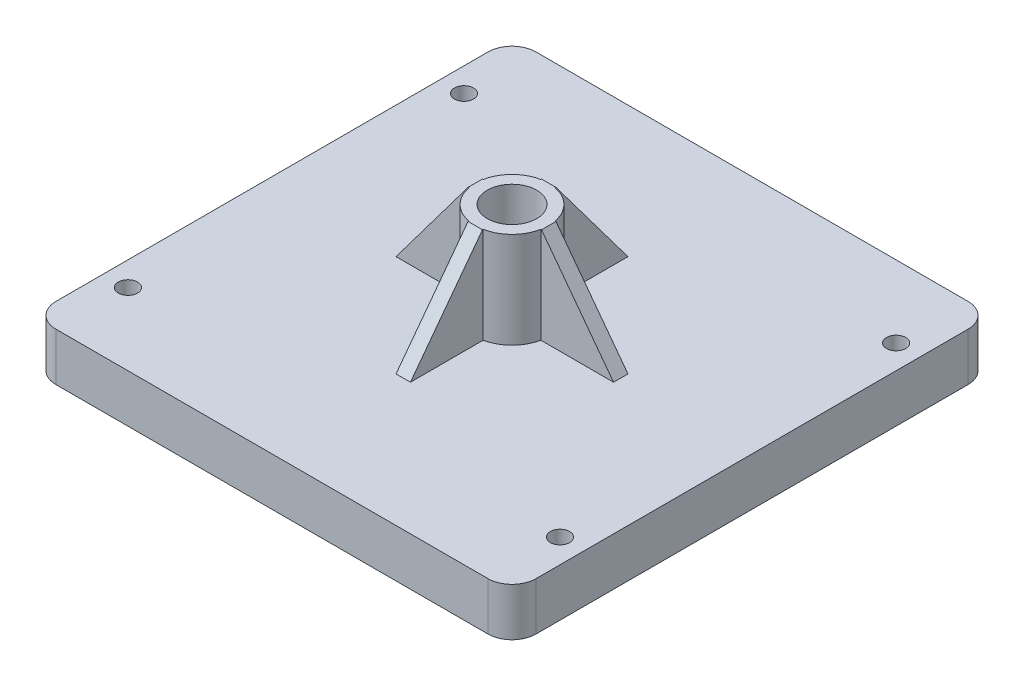
ISO-10303-21;
HEADER;
FILE_DESCRIPTION(('STEP AP214'),'2;1');
FILE_NAME('part.step','',(''),(''),'','','');
FILE_SCHEMA(('AUTOMOTIVE_DESIGN { 1 0 10303 214 1 1 1 1 }'));
ENDSEC;
DATA;
#1=APPLICATION_CONTEXT('core data for automotive mechanical design processes');
#2=APPLICATION_PROTOCOL_DEFINITION('international standard','automotive_design',2000,#1);
#3=PRODUCT_CONTEXT('',#1,'mechanical');
#4=PRODUCT('Part','Part','',(#3));
#5=PRODUCT_RELATED_PRODUCT_CATEGORY('part','',(#4));
#6=PRODUCT_DEFINITION_FORMATION('','',#4);
#7=PRODUCT_DEFINITION_CONTEXT('part definition',#1,'design');
#8=PRODUCT_DEFINITION('design','',#6,#7);
#9=PRODUCT_DEFINITION_SHAPE('','',#8);
#10=(LENGTH_UNIT() NAMED_UNIT(*) SI_UNIT(.MILLI.,.METRE.));
#11=(NAMED_UNIT(*) PLANE_ANGLE_UNIT() SI_UNIT($,.RADIAN.));
#12=(NAMED_UNIT(*) SI_UNIT($,.STERADIAN.) SOLID_ANGLE_UNIT());
#13=UNCERTAINTY_MEASURE_WITH_UNIT(LENGTH_MEASURE(1.E-05),#10,'distance_accuracy_value','');
#14=(GEOMETRIC_REPRESENTATION_CONTEXT(3) GLOBAL_UNCERTAINTY_ASSIGNED_CONTEXT((#13)) GLOBAL_UNIT_ASSIGNED_CONTEXT((#10,
#11,#12)) REPRESENTATION_CONTEXT('',''));
#15=CARTESIAN_POINT('',(0.,0.,0.));
#16=DIRECTION('',(0.,0.,1.));
#17=DIRECTION('',(1.,0.,0.));
#18=AXIS2_PLACEMENT_3D('',#15,#16,#17);
#19=CARTESIAN_POINT('',(0.,30.,0.));
#20=DIRECTION('',(0.,-1.,0.));
#21=DIRECTION('',(0.,0.,-1.));
#22=AXIS2_PLACEMENT_3D('',#19,#20,#21);
#23=CYLINDRICAL_SURFACE('',#22,7.65);
#24=DIRECTION('',(0.,-1.,0.));
#25=VECTOR('',#24,1.);
#26=CARTESIAN_POINT('',(-1.50000000000008,30.,7.50149985002998));
#27=LINE('',#26,#25);
#28=CARTESIAN_POINT('',(-1.50000000000008,30.,7.50149985002998));
#29=VERTEX_POINT('',#28);
#30=CARTESIAN_POINT('',(-1.50000000000008,10.,7.50149985002998));
#31=VERTEX_POINT('',#30);
#32=EDGE_CURVE('E304',#29,#31,#27,.T.);
#33=ORIENTED_EDGE('',*,*,#32,.F.);
#34=CARTESIAN_POINT('',(0.,30.,0.));
#35=DIRECTION('',(0.,1.,0.));
#36=DIRECTION('',(1.,0.,0.));
#37=AXIS2_PLACEMENT_3D('',#34,#35,#36);
#38=CIRCLE('',#37,7.65);
#39=CARTESIAN_POINT('',(-7.50149985002999,30.,1.5));
#40=VERTEX_POINT('',#39);
#41=EDGE_CURVE('E400',#40,#29,#38,.T.);
#42=ORIENTED_EDGE('',*,*,#41,.F.);
#43=DIRECTION('',(0.,-1.,0.));
#44=VECTOR('',#43,1.);
#45=CARTESIAN_POINT('',(-7.50149985002999,30.,1.5));
#46=LINE('',#45,#44);
#47=CARTESIAN_POINT('',(-7.50149985002999,10.,1.5));
#48=VERTEX_POINT('',#47);
#49=EDGE_CURVE('E385',#40,#48,#46,.T.);
#50=ORIENTED_EDGE('',*,*,#49,.T.);
#51=CARTESIAN_POINT('',(0.,10.,0.));
#52=DIRECTION('',(0.,1.,0.));
#53=DIRECTION('',(1.,0.,0.));
#54=AXIS2_PLACEMENT_3D('',#51,#52,#53);
#55=CIRCLE('',#54,7.65);
#56=EDGE_CURVE('E406',#48,#31,#55,.T.);
#57=ORIENTED_EDGE('',*,*,#56,.T.);
#58=EDGE_LOOP('',(#33,#42,#50,#57));
#59=FACE_BOUND('',#58,.T.);
#60=ADVANCED_FACE('F39',(#59),#23,.T.);
#61=CARTESIAN_POINT('',(1.49999999999992,30.,7.50149985003001));
#62=VERTEX_POINT('',#61);
#63=CARTESIAN_POINT('',(7.50149985002999,30.,1.5));
#64=VERTEX_POINT('',#63);
#65=EDGE_CURVE('E404',#62,#64,#38,.T.);
#66=ORIENTED_EDGE('',*,*,#65,.F.);
#67=DIRECTION('',(0.,-1.,0.));
#68=VECTOR('',#67,1.);
#69=CARTESIAN_POINT('',(1.49999999999992,30.,7.50149985003001));
#70=LINE('',#69,#68);
#71=CARTESIAN_POINT('',(1.49999999999992,10.,7.50149985003001));
#72=VERTEX_POINT('',#71);
#73=EDGE_CURVE('E308',#62,#72,#70,.T.);
#74=ORIENTED_EDGE('',*,*,#73,.T.);
#75=CARTESIAN_POINT('',(7.50149985002999,10.,1.5));
#76=VERTEX_POINT('',#75);
#77=EDGE_CURVE('E409',#72,#76,#55,.T.);
#78=ORIENTED_EDGE('',*,*,#77,.T.);
#79=DIRECTION('',(0.,-1.,0.));
#80=VECTOR('',#79,1.);
#81=CARTESIAN_POINT('',(7.50149985002999,30.,1.5));
#82=LINE('',#81,#80);
#83=EDGE_CURVE('E326',#64,#76,#82,.T.);
#84=ORIENTED_EDGE('',*,*,#83,.F.);
#85=EDGE_LOOP('',(#66,#74,#78,#84));
#86=FACE_BOUND('',#85,.T.);
#87=ADVANCED_FACE('F535',(#86),#23,.T.);
#88=CARTESIAN_POINT('',(-1.49999999999997,30.,-7.50149985003));
#89=VERTEX_POINT('',#88);
#90=CARTESIAN_POINT('',(-7.50149985002999,30.,-1.5));
#91=VERTEX_POINT('',#90);
#92=EDGE_CURVE('E405',#89,#91,#38,.T.);
#93=ORIENTED_EDGE('',*,*,#92,.F.);
#94=DIRECTION('',(0.,-1.,0.));
#95=VECTOR('',#94,1.);
#96=CARTESIAN_POINT('',(-1.49999999999997,30.,-7.50149985003));
#97=LINE('',#96,#95);
#98=CARTESIAN_POINT('',(-1.49999999999997,10.,-7.50149985003));
#99=VERTEX_POINT('',#98);
#100=EDGE_CURVE('E358',#89,#99,#97,.T.);
#101=ORIENTED_EDGE('',*,*,#100,.T.);
#102=CARTESIAN_POINT('',(-7.50149985002999,10.,-1.5));
#103=VERTEX_POINT('',#102);
#104=EDGE_CURVE('E399',#99,#103,#55,.T.);
#105=ORIENTED_EDGE('',*,*,#104,.T.);
#106=DIRECTION('',(0.,-1.,0.));
#107=VECTOR('',#106,1.);
#108=CARTESIAN_POINT('',(-7.50149985002999,30.,-1.5));
#109=LINE('',#108,#107);
#110=EDGE_CURVE('E381',#91,#103,#109,.T.);
#111=ORIENTED_EDGE('',*,*,#110,.F.);
#112=EDGE_LOOP('',(#93,#101,#105,#111));
#113=FACE_BOUND('',#112,.T.);
#114=ADVANCED_FACE('F542',(#113),#23,.T.);
#115=CARTESIAN_POINT('',(50.,10.,-50.));
#116=DIRECTION('',(-1.,0.,0.));
#117=DIRECTION('',(0.,0.,1.));
#118=AXIS2_PLACEMENT_3D('',#115,#116,#117);
#119=PLANE('',#118);
#120=DIRECTION('',(0.,0.,-1.));
#121=VECTOR('',#120,1.);
#122=CARTESIAN_POINT('',(50.,0.,-50.));
#123=LINE('',#122,#121);
#124=CARTESIAN_POINT('',(50.,0.,45.));
#125=VERTEX_POINT('',#124);
#126=CARTESIAN_POINT('',(50.,0.,-45.));
#127=VERTEX_POINT('',#126);
#128=EDGE_CURVE('E431',#125,#127,#123,.T.);
#129=ORIENTED_EDGE('',*,*,#128,.T.);
#130=DIRECTION('',(0.,-1.,0.));
#131=VECTOR('',#130,1.);
#132=CARTESIAN_POINT('',(50.,10.,-45.));
#133=LINE('',#132,#131);
#134=CARTESIAN_POINT('',(50.,10.,-45.));
#135=VERTEX_POINT('',#134);
#136=EDGE_CURVE('E12',#127,#135,#133,.F.);
#137=ORIENTED_EDGE('',*,*,#136,.T.);
#138=DIRECTION('',(0.,0.,-1.));
#139=VECTOR('',#138,1.);
#140=CARTESIAN_POINT('',(50.,10.,-50.));
#141=LINE('',#140,#139);
#142=CARTESIAN_POINT('',(50.,10.,45.));
#143=VERTEX_POINT('',#142);
#144=EDGE_CURVE('E434',#143,#135,#141,.T.);
#145=ORIENTED_EDGE('',*,*,#144,.F.);
#146=DIRECTION('',(0.,-1.,0.));
#147=VECTOR('',#146,1.);
#148=CARTESIAN_POINT('',(50.,10.,45.));
#149=LINE('',#148,#147);
#150=EDGE_CURVE('E47',#143,#125,#149,.T.);
#151=ORIENTED_EDGE('',*,*,#150,.T.);
#152=EDGE_LOOP('',(#129,#137,#145,#151));
#153=FACE_BOUND('',#152,.T.);
#154=ADVANCED_FACE('F491',(#153),#119,.F.);
#155=CARTESIAN_POINT('',(-50.,10.,-50.));
#156=DIRECTION('',(0.,0.,1.));
#157=DIRECTION('',(1.,0.,0.));
#158=AXIS2_PLACEMENT_3D('',#155,#156,#157);
#159=PLANE('',#158);
#160=DIRECTION('',(-1.,0.,0.));
#161=VECTOR('',#160,1.);
#162=CARTESIAN_POINT('',(-50.,0.,-50.));
#163=LINE('',#162,#161);
#164=CARTESIAN_POINT('',(45.,0.,-50.));
#165=VERTEX_POINT('',#164);
#166=CARTESIAN_POINT('',(-45.,0.,-50.));
#167=VERTEX_POINT('',#166);
#168=EDGE_CURVE('E448',#165,#167,#163,.T.);
#169=ORIENTED_EDGE('',*,*,#168,.T.);
#170=DIRECTION('',(0.,-1.,0.));
#171=VECTOR('',#170,1.);
#172=CARTESIAN_POINT('',(-45.,10.,-50.));
#173=LINE('',#172,#171);
#174=CARTESIAN_POINT('',(-45.,10.,-50.));
#175=VERTEX_POINT('',#174);
#176=EDGE_CURVE('E487',#167,#175,#173,.F.);
#177=ORIENTED_EDGE('',*,*,#176,.T.);
#178=DIRECTION('',(-1.,0.,0.));
#179=VECTOR('',#178,1.);
#180=CARTESIAN_POINT('',(-50.,10.,-50.));
#181=LINE('',#180,#179);
#182=CARTESIAN_POINT('',(45.,10.,-50.));
#183=VERTEX_POINT('',#182);
#184=EDGE_CURVE('E436',#183,#175,#181,.T.);
#185=ORIENTED_EDGE('',*,*,#184,.F.);
#186=DIRECTION('',(0.,-1.,0.));
#187=VECTOR('',#186,1.);
#188=CARTESIAN_POINT('',(45.,10.,-50.));
#189=LINE('',#188,#187);
#190=EDGE_CURVE('E484',#183,#165,#189,.T.);
#191=ORIENTED_EDGE('',*,*,#190,.T.);
#192=EDGE_LOOP('',(#169,#177,#185,#191));
#193=FACE_BOUND('',#192,.T.);
#194=ADVANCED_FACE('F505',(#193),#159,.F.);
#195=CARTESIAN_POINT('',(-50.,10.,-50.));
#196=DIRECTION('',(1.,0.,0.));
#197=DIRECTION('',(0.,0.,-1.));
#198=AXIS2_PLACEMENT_3D('',#195,#196,#197);
#199=PLANE('',#198);
#200=DIRECTION('',(0.,0.,1.));
#201=VECTOR('',#200,1.);
#202=CARTESIAN_POINT('',(-50.,0.,-50.));
#203=LINE('',#202,#201);
#204=CARTESIAN_POINT('',(-50.,0.,-45.));
#205=VERTEX_POINT('',#204);
#206=CARTESIAN_POINT('',(-50.,0.,45.));
#207=VERTEX_POINT('',#206);
#208=EDGE_CURVE('E451',#205,#207,#203,.T.);
#209=ORIENTED_EDGE('',*,*,#208,.T.);
#210=DIRECTION('',(0.,-1.,0.));
#211=VECTOR('',#210,1.);
#212=CARTESIAN_POINT('',(-50.,10.,45.));
#213=LINE('',#212,#211);
#214=CARTESIAN_POINT('',(-50.,10.,45.));
#215=VERTEX_POINT('',#214);
#216=EDGE_CURVE('E474',#207,#215,#213,.F.);
#217=ORIENTED_EDGE('',*,*,#216,.T.);
#218=DIRECTION('',(0.,0.,1.));
#219=VECTOR('',#218,1.);
#220=CARTESIAN_POINT('',(-50.,10.,-50.));
#221=LINE('',#220,#219);
#222=CARTESIAN_POINT('',(-50.,10.,-45.));
#223=VERTEX_POINT('',#222);
#224=EDGE_CURVE('E440',#223,#215,#221,.T.);
#225=ORIENTED_EDGE('',*,*,#224,.F.);
#226=DIRECTION('',(0.,-1.,0.));
#227=VECTOR('',#226,1.);
#228=CARTESIAN_POINT('',(-50.,10.,-45.));
#229=LINE('',#228,#227);
#230=EDGE_CURVE('E471',#223,#205,#229,.T.);
#231=ORIENTED_EDGE('',*,*,#230,.T.);
#232=EDGE_LOOP('',(#209,#217,#225,#231));
#233=FACE_BOUND('',#232,.T.);
#234=ADVANCED_FACE('F517',(#233),#199,.F.);
#235=CARTESIAN_POINT('',(-50.,10.,50.));
#236=DIRECTION('',(0.,0.,-1.));
#237=DIRECTION('',(-1.,0.,0.));
#238=AXIS2_PLACEMENT_3D('',#235,#236,#237);
#239=PLANE('',#238);
#240=DIRECTION('',(1.,0.,0.));
#241=VECTOR('',#240,1.);
#242=CARTESIAN_POINT('',(-50.,10.,50.));
#243=LINE('',#242,#241);
#244=CARTESIAN_POINT('',(-45.,10.,50.));
#245=VERTEX_POINT('',#244);
#246=CARTESIAN_POINT('',(45.,10.,50.));
#247=VERTEX_POINT('',#246);
#248=EDGE_CURVE('E443',#245,#247,#243,.T.);
#249=ORIENTED_EDGE('',*,*,#248,.F.);
#250=DIRECTION('',(0.,-1.,0.));
#251=VECTOR('',#250,1.);
#252=CARTESIAN_POINT('',(-45.,10.,50.));
#253=LINE('',#252,#251);
#254=CARTESIAN_POINT('',(-45.,0.,50.));
#255=VERTEX_POINT('',#254);
#256=EDGE_CURVE('E460',#245,#255,#253,.T.);
#257=ORIENTED_EDGE('',*,*,#256,.T.);
#258=DIRECTION('',(1.,0.,0.));
#259=VECTOR('',#258,1.);
#260=CARTESIAN_POINT('',(-50.,0.,50.));
#261=LINE('',#260,#259);
#262=CARTESIAN_POINT('',(45.,0.,50.));
#263=VERTEX_POINT('',#262);
#264=EDGE_CURVE('E437',#255,#263,#261,.T.);
#265=ORIENTED_EDGE('',*,*,#264,.T.);
#266=DIRECTION('',(0.,-1.,0.));
#267=VECTOR('',#266,1.);
#268=CARTESIAN_POINT('',(45.,10.,50.));
#269=LINE('',#268,#267);
#270=EDGE_CURVE('E458',#263,#247,#269,.F.);
#271=ORIENTED_EDGE('',*,*,#270,.T.);
#272=EDGE_LOOP('',(#249,#257,#265,#271));
#273=FACE_BOUND('',#272,.T.);
#274=ADVANCED_FACE('F525',(#273),#239,.F.);
#275=CARTESIAN_POINT('',(0.,10.,0.));
#276=DIRECTION('',(0.,1.,0.));
#277=DIRECTION('',(0.,0.,1.));
#278=AXIS2_PLACEMENT_3D('',#275,#276,#277);
#279=PLANE('',#278);
#280=ORIENTED_EDGE('',*,*,#224,.T.);
#281=CARTESIAN_POINT('',(-45.,10.,45.));
#282=DIRECTION('',(0.,1.,0.));
#283=DIRECTION('',(0.,0.,1.));
#284=AXIS2_PLACEMENT_3D('',#281,#282,#283);
#285=CIRCLE('',#284,5.);
#286=EDGE_CURVE('E482',#215,#245,#285,.T.);
#287=ORIENTED_EDGE('',*,*,#286,.T.);
#288=ORIENTED_EDGE('',*,*,#248,.T.);
#289=CARTESIAN_POINT('',(45.,10.,45.));
#290=DIRECTION('',(0.,1.,0.));
#291=DIRECTION('',(0.,0.,1.));
#292=AXIS2_PLACEMENT_3D('',#289,#290,#291);
#293=CIRCLE('',#292,5.);
#294=EDGE_CURVE('E476',#247,#143,#293,.T.);
#295=ORIENTED_EDGE('',*,*,#294,.T.);
#296=ORIENTED_EDGE('',*,*,#144,.T.);
#297=CARTESIAN_POINT('',(45.,10.,-45.));
#298=DIRECTION('',(0.,1.,0.));
#299=DIRECTION('',(0.,0.,1.));
#300=AXIS2_PLACEMENT_3D('',#297,#298,#299);
#301=CIRCLE('',#300,5.);
#302=EDGE_CURVE('E478',#135,#183,#301,.T.);
#303=ORIENTED_EDGE('',*,*,#302,.T.);
#304=ORIENTED_EDGE('',*,*,#184,.T.);
#305=CARTESIAN_POINT('',(-45.,10.,-45.));
#306=DIRECTION('',(0.,1.,0.));
#307=DIRECTION('',(0.,0.,1.));
#308=AXIS2_PLACEMENT_3D('',#305,#306,#307);
#309=CIRCLE('',#308,5.);
#310=EDGE_CURVE('E480',#175,#223,#309,.T.);
#311=ORIENTED_EDGE('',*,*,#310,.T.);
#312=EDGE_LOOP('',(#280,#287,#288,#295,#296,#303,#304,#311));
#313=FACE_BOUND('',#312,.T.);
#314=DIRECTION('',(1.,0.,0.));
#315=VECTOR('',#314,1.);
#316=CARTESIAN_POINT('',(0.,10.,-22.65));
#317=LINE('',#316,#315);
#318=CARTESIAN_POINT('',(1.50000000000008,10.,-22.65));
#319=VERTEX_POINT('',#318);
#320=CARTESIAN_POINT('',(-1.49999999999997,10.,-22.65));
#321=VERTEX_POINT('',#320);
#322=EDGE_CURVE('E364',#319,#321,#317,.F.);
#323=ORIENTED_EDGE('',*,*,#322,.F.);
#324=DIRECTION('',(0.,0.,1.));
#325=VECTOR('',#324,1.);
#326=CARTESIAN_POINT('',(1.5,10.,0.));
#327=LINE('',#326,#325);
#328=CARTESIAN_POINT('',(1.50000000000003,10.,-7.50149985002999));
#329=VERTEX_POINT('',#328);
#330=EDGE_CURVE('E355',#319,#329,#327,.T.);
#331=ORIENTED_EDGE('',*,*,#330,.T.);
#332=CARTESIAN_POINT('',(7.50149985002999,10.,-1.5));
#333=VERTEX_POINT('',#332);
#334=EDGE_CURVE('E587',#333,#329,#55,.T.);
#335=ORIENTED_EDGE('',*,*,#334,.F.);
#336=DIRECTION('',(-1.,0.,0.));
#337=VECTOR('',#336,1.);
#338=CARTESIAN_POINT('',(0.,10.,-1.5));
#339=LINE('',#338,#337);
#340=CARTESIAN_POINT('',(22.65,10.,-1.5));
#341=VERTEX_POINT('',#340);
#342=EDGE_CURVE('E333',#341,#333,#339,.T.);
#343=ORIENTED_EDGE('',*,*,#342,.F.);
#344=DIRECTION('',(0.,0.,1.));
#345=VECTOR('',#344,1.);
#346=CARTESIAN_POINT('',(22.65,10.,0.));
#347=LINE('',#346,#345);
#348=CARTESIAN_POINT('',(22.65,10.,1.5));
#349=VERTEX_POINT('',#348);
#350=EDGE_CURVE('E336',#349,#341,#347,.F.);
#351=ORIENTED_EDGE('',*,*,#350,.F.);
#352=DIRECTION('',(-1.,0.,0.));
#353=VECTOR('',#352,1.);
#354=CARTESIAN_POINT('',(0.,10.,1.5));
#355=LINE('',#354,#353);
#356=EDGE_CURVE('E327',#349,#76,#355,.T.);
#357=ORIENTED_EDGE('',*,*,#356,.T.);
#358=ORIENTED_EDGE('',*,*,#77,.F.);
#359=DIRECTION('',(0.,0.,-1.));
#360=VECTOR('',#359,1.);
#361=CARTESIAN_POINT('',(1.5,10.,0.));
#362=LINE('',#361,#360);
#363=CARTESIAN_POINT('',(1.49999999999976,10.,22.65));
#364=VERTEX_POINT('',#363);
#365=EDGE_CURVE('E306',#364,#72,#362,.T.);
#366=ORIENTED_EDGE('',*,*,#365,.F.);
#367=DIRECTION('',(-1.,0.,0.));
#368=VECTOR('',#367,1.);
#369=CARTESIAN_POINT('',(-2.37246156974391E-13,10.,22.65));
#370=LINE('',#369,#368);
#371=CARTESIAN_POINT('',(-1.50000000000024,10.,22.65));
#372=VERTEX_POINT('',#371);
#373=EDGE_CURVE('E311',#372,#364,#370,.F.);
#374=ORIENTED_EDGE('',*,*,#373,.F.);
#375=DIRECTION('',(0.,0.,-1.));
#376=VECTOR('',#375,1.);
#377=CARTESIAN_POINT('',(-1.5,10.,0.));
#378=LINE('',#377,#376);
#379=EDGE_CURVE('E301',#372,#31,#378,.T.);
#380=ORIENTED_EDGE('',*,*,#379,.T.);
#381=ORIENTED_EDGE('',*,*,#56,.F.);
#382=DIRECTION('',(1.,0.,0.));
#383=VECTOR('',#382,1.);
#384=CARTESIAN_POINT('',(0.,10.,1.5));
#385=LINE('',#384,#383);
#386=CARTESIAN_POINT('',(-22.65,10.,1.5));
#387=VERTEX_POINT('',#386);
#388=EDGE_CURVE('E388',#387,#48,#385,.T.);
#389=ORIENTED_EDGE('',*,*,#388,.F.);
#390=DIRECTION('',(0.,0.,-1.));
#391=VECTOR('',#390,1.);
#392=CARTESIAN_POINT('',(-22.65,10.,0.));
#393=LINE('',#392,#391);
#394=CARTESIAN_POINT('',(-22.65,10.,-1.5));
#395=VERTEX_POINT('',#394);
#396=EDGE_CURVE('E391',#395,#387,#393,.F.);
#397=ORIENTED_EDGE('',*,*,#396,.F.);
#398=DIRECTION('',(1.,0.,0.));
#399=VECTOR('',#398,1.);
#400=CARTESIAN_POINT('',(0.,10.,-1.5));
#401=LINE('',#400,#399);
#402=EDGE_CURVE('E382',#395,#103,#401,.T.);
#403=ORIENTED_EDGE('',*,*,#402,.T.);
#404=ORIENTED_EDGE('',*,*,#104,.F.);
#405=DIRECTION('',(0.,0.,1.));
#406=VECTOR('',#405,1.);
#407=CARTESIAN_POINT('',(-1.5,10.,0.));
#408=LINE('',#407,#406);
#409=EDGE_CURVE('E361',#321,#99,#408,.T.);
#410=ORIENTED_EDGE('',*,*,#409,.F.);
#411=EDGE_LOOP('',(#323,#331,#335,#343,#351,#357,#358,#366,#374,#380,#381,#389,#397,#403,#404,#410));
#412=FACE_BOUND('',#411,.T.);
#413=CARTESIAN_POINT('',(-45.,10.,35.));
#414=DIRECTION('',(0.,1.,0.));
#415=DIRECTION('',(0.,0.,1.));
#416=AXIS2_PLACEMENT_3D('',#413,#414,#415);
#417=CIRCLE('',#416,2.);
#418=CARTESIAN_POINT('',(-45.,10.,37.));
#419=VERTEX_POINT('',#418);
#420=EDGE_CURVE('E403',#419,#419,#417,.T.);
#421=ORIENTED_EDGE('',*,*,#420,.F.);
#422=EDGE_LOOP('',(#421));
#423=FACE_BOUND('',#422,.T.);
#424=CARTESIAN_POINT('',(45.,10.,35.));
#425=DIRECTION('',(0.,1.,0.));
#426=DIRECTION('',(0.,0.,1.));
#427=AXIS2_PLACEMENT_3D('',#424,#425,#426);
#428=CIRCLE('',#427,2.);
#429=CARTESIAN_POINT('',(45.,10.,37.));
#430=VERTEX_POINT('',#429);
#431=EDGE_CURVE('E420',#430,#430,#428,.T.);
#432=ORIENTED_EDGE('',*,*,#431,.F.);
#433=EDGE_LOOP('',(#432));
#434=FACE_BOUND('',#433,.T.);
#435=CARTESIAN_POINT('',(45.,10.,-35.));
#436=DIRECTION('',(0.,1.,0.));
#437=DIRECTION('',(0.,0.,1.));
#438=AXIS2_PLACEMENT_3D('',#435,#436,#437);
#439=CIRCLE('',#438,2.);
#440=CARTESIAN_POINT('',(45.,10.,-33.));
#441=VERTEX_POINT('',#440);
#442=EDGE_CURVE('E414',#441,#441,#439,.T.);
#443=ORIENTED_EDGE('',*,*,#442,.F.);
#444=EDGE_LOOP('',(#443));
#445=FACE_BOUND('',#444,.T.);
#446=CARTESIAN_POINT('',(-45.,10.,-35.));
#447=DIRECTION('',(0.,1.,0.));
#448=DIRECTION('',(0.,0.,1.));
#449=AXIS2_PLACEMENT_3D('',#446,#447,#448);
#450=CIRCLE('',#449,2.);
#451=CARTESIAN_POINT('',(-45.,10.,-33.));
#452=VERTEX_POINT('',#451);
#453=EDGE_CURVE('E413',#452,#452,#450,.T.);
#454=ORIENTED_EDGE('',*,*,#453,.F.);
#455=EDGE_LOOP('',(#454));
#456=FACE_BOUND('',#455,.T.);
#457=ADVANCED_FACE('F509',(#313,#412,#423,#434,#445,#456),#279,.T.);
#458=CARTESIAN_POINT('',(0.,0.,0.));
#459=DIRECTION('',(0.,1.,0.));
#460=DIRECTION('',(0.,0.,1.));
#461=AXIS2_PLACEMENT_3D('',#458,#459,#460);
#462=PLANE('',#461);
#463=DIRECTION('',(0.5,0.,0.866025403784439));
#464=VECTOR('',#463,1.);
#465=CARTESIAN_POINT('',(4.67653718043597,0.,-8.1));
#466=LINE('',#465,#464);
#467=CARTESIAN_POINT('',(4.67653718043597,0.,-8.1));
#468=VERTEX_POINT('',#467);
#469=CARTESIAN_POINT('',(9.35307436087194,0.,0.));
#470=VERTEX_POINT('',#469);
#471=EDGE_CURVE('E271',#468,#470,#466,.T.);
#472=ORIENTED_EDGE('',*,*,#471,.F.);
#473=DIRECTION('',(1.,0.,0.));
#474=VECTOR('',#473,1.);
#475=CARTESIAN_POINT('',(-4.67653718043597,0.,-8.1));
#476=LINE('',#475,#474);
#477=CARTESIAN_POINT('',(-4.67653718043597,0.,-8.1));
#478=VERTEX_POINT('',#477);
#479=EDGE_CURVE('E54',#478,#468,#476,.T.);
#480=ORIENTED_EDGE('',*,*,#479,.F.);
#481=DIRECTION('',(0.5,0.,-0.866025403784439));
#482=VECTOR('',#481,1.);
#483=CARTESIAN_POINT('',(-9.35307436087194,0.,0.));
#484=LINE('',#483,#482);
#485=CARTESIAN_POINT('',(-9.35307436087194,0.,0.));
#486=VERTEX_POINT('',#485);
#487=EDGE_CURVE('E257',#486,#478,#484,.T.);
#488=ORIENTED_EDGE('',*,*,#487,.F.);
#489=DIRECTION('',(-0.5,0.,-0.866025403784439));
#490=VECTOR('',#489,1.);
#491=CARTESIAN_POINT('',(-4.67653718043597,0.,8.1));
#492=LINE('',#491,#490);
#493=CARTESIAN_POINT('',(-4.67653718043597,0.,8.1));
#494=VERTEX_POINT('',#493);
#495=EDGE_CURVE('E260',#494,#486,#492,.T.);
#496=ORIENTED_EDGE('',*,*,#495,.F.);
#497=DIRECTION('',(-1.,0.,0.));
#498=VECTOR('',#497,1.);
#499=CARTESIAN_POINT('',(4.67653718043597,0.,8.1));
#500=LINE('',#499,#498);
#501=CARTESIAN_POINT('',(4.67653718043597,0.,8.1));
#502=VERTEX_POINT('',#501);
#503=EDGE_CURVE('E276',#502,#494,#500,.T.);
#504=ORIENTED_EDGE('',*,*,#503,.F.);
#505=DIRECTION('',(-0.5,0.,0.866025403784439));
#506=VECTOR('',#505,1.);
#507=CARTESIAN_POINT('',(9.35307436087194,0.,0.));
#508=LINE('',#507,#506);
#509=EDGE_CURVE('E273',#470,#502,#508,.T.);
#510=ORIENTED_EDGE('',*,*,#509,.F.);
#511=EDGE_LOOP('',(#472,#480,#488,#496,#504,#510));
#512=FACE_BOUND('',#511,.T.);
#513=ORIENTED_EDGE('',*,*,#264,.F.);
#514=CARTESIAN_POINT('',(-45.,0.,45.));
#515=DIRECTION('',(0.,1.,0.));
#516=DIRECTION('',(0.,0.,1.));
#517=AXIS2_PLACEMENT_3D('',#514,#515,#516);
#518=CIRCLE('',#517,5.);
#519=EDGE_CURVE('E469',#255,#207,#518,.F.);
#520=ORIENTED_EDGE('',*,*,#519,.T.);
#521=ORIENTED_EDGE('',*,*,#208,.F.);
#522=CARTESIAN_POINT('',(-45.,0.,-45.));
#523=DIRECTION('',(0.,1.,0.));
#524=DIRECTION('',(0.,0.,1.));
#525=AXIS2_PLACEMENT_3D('',#522,#523,#524);
#526=CIRCLE('',#525,5.);
#527=EDGE_CURVE('E467',#205,#167,#526,.F.);
#528=ORIENTED_EDGE('',*,*,#527,.T.);
#529=ORIENTED_EDGE('',*,*,#168,.F.);
#530=CARTESIAN_POINT('',(45.,0.,-45.));
#531=DIRECTION('',(0.,1.,0.));
#532=DIRECTION('',(0.,0.,1.));
#533=AXIS2_PLACEMENT_3D('',#530,#531,#532);
#534=CIRCLE('',#533,5.);
#535=EDGE_CURVE('E465',#165,#127,#534,.F.);
#536=ORIENTED_EDGE('',*,*,#535,.T.);
#537=ORIENTED_EDGE('',*,*,#128,.F.);
#538=CARTESIAN_POINT('',(45.,0.,45.));
#539=DIRECTION('',(0.,1.,0.));
#540=DIRECTION('',(0.,0.,1.));
#541=AXIS2_PLACEMENT_3D('',#538,#539,#540);
#542=CIRCLE('',#541,5.);
#543=EDGE_CURVE('E463',#125,#263,#542,.F.);
#544=ORIENTED_EDGE('',*,*,#543,.T.);
#545=EDGE_LOOP('',(#513,#520,#521,#528,#529,#536,#537,#544));
#546=FACE_BOUND('',#545,.T.);
#547=CARTESIAN_POINT('',(-45.,0.,35.));
#548=DIRECTION('',(0.,1.,0.));
#549=DIRECTION('',(0.,0.,1.));
#550=AXIS2_PLACEMENT_3D('',#547,#548,#549);
#551=CIRCLE('',#550,2.);
#552=CARTESIAN_POINT('',(-45.,0.,37.));
#553=VERTEX_POINT('',#552);
#554=EDGE_CURVE('E423',#553,#553,#551,.T.);
#555=ORIENTED_EDGE('',*,*,#554,.T.);
#556=EDGE_LOOP('',(#555));
#557=FACE_BOUND('',#556,.T.);
#558=CARTESIAN_POINT('',(45.,0.,35.));
#559=DIRECTION('',(0.,1.,0.));
#560=DIRECTION('',(0.,0.,1.));
#561=AXIS2_PLACEMENT_3D('',#558,#559,#560);
#562=CIRCLE('',#561,2.);
#563=CARTESIAN_POINT('',(45.,0.,37.));
#564=VERTEX_POINT('',#563);
#565=EDGE_CURVE('E417',#564,#564,#562,.T.);
#566=ORIENTED_EDGE('',*,*,#565,.T.);
#567=EDGE_LOOP('',(#566));
#568=FACE_BOUND('',#567,.T.);
#569=CARTESIAN_POINT('',(45.,0.,-35.));
#570=DIRECTION('',(0.,1.,0.));
#571=DIRECTION('',(0.,0.,1.));
#572=AXIS2_PLACEMENT_3D('',#569,#570,#571);
#573=CIRCLE('',#572,2.);
#574=CARTESIAN_POINT('',(45.,0.,-33.));
#575=VERTEX_POINT('',#574);
#576=EDGE_CURVE('E410',#575,#575,#573,.T.);
#577=ORIENTED_EDGE('',*,*,#576,.T.);
#578=EDGE_LOOP('',(#577));
#579=FACE_BOUND('',#578,.T.);
#580=CARTESIAN_POINT('',(-45.,0.,-35.));
#581=DIRECTION('',(0.,1.,0.));
#582=DIRECTION('',(0.,0.,1.));
#583=AXIS2_PLACEMENT_3D('',#580,#581,#582);
#584=CIRCLE('',#583,2.);
#585=CARTESIAN_POINT('',(-45.,0.,-33.));
#586=VERTEX_POINT('',#585);
#587=EDGE_CURVE('E428',#586,#586,#584,.T.);
#588=ORIENTED_EDGE('',*,*,#587,.T.);
#589=EDGE_LOOP('',(#588));
#590=FACE_BOUND('',#589,.T.);
#591=ADVANCED_FACE('F496',(#512,#546,#557,#568,#579,#590),#462,.F.);
#592=CARTESIAN_POINT('',(-45.,0.,-35.));
#593=DIRECTION('',(0.,1.,0.));
#594=DIRECTION('',(0.,0.,1.));
#595=AXIS2_PLACEMENT_3D('',#592,#593,#594);
#596=CYLINDRICAL_SURFACE('',#595,2.);
#597=ORIENTED_EDGE('',*,*,#587,.F.);
#598=EDGE_LOOP('',(#597));
#599=FACE_BOUND('',#598,.T.);
#600=ORIENTED_EDGE('',*,*,#453,.T.);
#601=EDGE_LOOP('',(#600));
#602=FACE_BOUND('',#601,.T.);
#603=ADVANCED_FACE('F780',(#599,#602),#596,.F.);
#604=CARTESIAN_POINT('',(45.,0.,-35.));
#605=DIRECTION('',(0.,1.,0.));
#606=DIRECTION('',(0.,0.,1.));
#607=AXIS2_PLACEMENT_3D('',#604,#605,#606);
#608=CYLINDRICAL_SURFACE('',#607,2.);
#609=ORIENTED_EDGE('',*,*,#576,.F.);
#610=EDGE_LOOP('',(#609));
#611=FACE_BOUND('',#610,.T.);
#612=ORIENTED_EDGE('',*,*,#442,.T.);
#613=EDGE_LOOP('',(#612));
#614=FACE_BOUND('',#613,.T.);
#615=ADVANCED_FACE('F856',(#611,#614),#608,.F.);
#616=CARTESIAN_POINT('',(45.,0.,35.));
#617=DIRECTION('',(0.,1.,0.));
#618=DIRECTION('',(0.,0.,1.));
#619=AXIS2_PLACEMENT_3D('',#616,#617,#618);
#620=CYLINDRICAL_SURFACE('',#619,2.);
#621=ORIENTED_EDGE('',*,*,#565,.F.);
#622=EDGE_LOOP('',(#621));
#623=FACE_BOUND('',#622,.T.);
#624=ORIENTED_EDGE('',*,*,#431,.T.);
#625=EDGE_LOOP('',(#624));
#626=FACE_BOUND('',#625,.T.);
#627=ADVANCED_FACE('F863',(#623,#626),#620,.F.);
#628=CARTESIAN_POINT('',(-45.,0.,35.));
#629=DIRECTION('',(0.,1.,0.));
#630=DIRECTION('',(0.,0.,1.));
#631=AXIS2_PLACEMENT_3D('',#628,#629,#630);
#632=CYLINDRICAL_SURFACE('',#631,2.);
#633=ORIENTED_EDGE('',*,*,#554,.F.);
#634=EDGE_LOOP('',(#633));
#635=FACE_BOUND('',#634,.T.);
#636=ORIENTED_EDGE('',*,*,#420,.T.);
#637=EDGE_LOOP('',(#636));
#638=FACE_BOUND('',#637,.T.);
#639=ADVANCED_FACE('F558',(#635,#638),#632,.F.);
#640=CARTESIAN_POINT('',(0.,30.,0.));
#641=DIRECTION('',(0.,1.,0.));
#642=DIRECTION('',(0.,0.,1.));
#643=AXIS2_PLACEMENT_3D('',#640,#641,#642);
#644=PLANE('',#643);
#645=CARTESIAN_POINT('',(0.,30.,0.));
#646=DIRECTION('',(0.,1.,0.));
#647=DIRECTION('',(0.,0.,1.));
#648=AXIS2_PLACEMENT_3D('',#645,#646,#647);
#649=CIRCLE('',#648,5.15);
#650=CARTESIAN_POINT('',(0.,30.,5.15));
#651=VERTEX_POINT('',#650);
#652=EDGE_CURVE('E396',#651,#651,#649,.T.);
#653=ORIENTED_EDGE('',*,*,#652,.F.);
#654=EDGE_LOOP('',(#653));
#655=FACE_BOUND('',#654,.T.);
#656=ORIENTED_EDGE('',*,*,#41,.T.);
#657=DIRECTION('',(0.,0.,-1.));
#658=VECTOR('',#657,1.);
#659=CARTESIAN_POINT('',(-1.5,30.,0.));
#660=LINE('',#659,#658);
#661=CARTESIAN_POINT('',(-1.50000000000008,30.,7.64999999999999));
#662=VERTEX_POINT('',#661);
#663=EDGE_CURVE('E283',#662,#29,#660,.T.);
#664=ORIENTED_EDGE('',*,*,#663,.F.);
#665=DIRECTION('',(1.,0.,0.));
#666=VECTOR('',#665,1.);
#667=CARTESIAN_POINT('',(0.,30.,7.65));
#668=LINE('',#667,#666);
#669=CARTESIAN_POINT('',(1.49999999999992,30.,7.65000000000002));
#670=VERTEX_POINT('',#669);
#671=EDGE_CURVE('E294',#662,#670,#668,.T.);
#672=ORIENTED_EDGE('',*,*,#671,.T.);
#673=DIRECTION('',(0.,0.,-1.));
#674=VECTOR('',#673,1.);
#675=CARTESIAN_POINT('',(1.5,30.,0.));
#676=LINE('',#675,#674);
#677=EDGE_CURVE('E295',#670,#62,#676,.T.);
#678=ORIENTED_EDGE('',*,*,#677,.T.);
#679=ORIENTED_EDGE('',*,*,#65,.T.);
#680=DIRECTION('',(-1.,0.,0.));
#681=VECTOR('',#680,1.);
#682=CARTESIAN_POINT('',(0.,30.,1.5));
#683=LINE('',#682,#681);
#684=CARTESIAN_POINT('',(7.65,30.,1.5));
#685=VERTEX_POINT('',#684);
#686=EDGE_CURVE('E313',#685,#64,#683,.T.);
#687=ORIENTED_EDGE('',*,*,#686,.F.);
#688=DIRECTION('',(0.,0.,-1.));
#689=VECTOR('',#688,1.);
#690=CARTESIAN_POINT('',(7.65,30.,0.));
#691=LINE('',#690,#689);
#692=CARTESIAN_POINT('',(7.65,30.,-1.5));
#693=VERTEX_POINT('',#692);
#694=EDGE_CURVE('E317',#685,#693,#691,.T.);
#695=ORIENTED_EDGE('',*,*,#694,.T.);
#696=DIRECTION('',(-1.,0.,0.));
#697=VECTOR('',#696,1.);
#698=CARTESIAN_POINT('',(0.,30.,-1.5));
#699=LINE('',#698,#697);
#700=CARTESIAN_POINT('',(7.50149985002999,30.,-1.5));
#701=VERTEX_POINT('',#700);
#702=EDGE_CURVE('E318',#693,#701,#699,.T.);
#703=ORIENTED_EDGE('',*,*,#702,.T.);
#704=CARTESIAN_POINT('',(1.50000000000003,30.,-7.50149985002999));
#705=VERTEX_POINT('',#704);
#706=EDGE_CURVE('E571',#701,#705,#38,.T.);
#707=ORIENTED_EDGE('',*,*,#706,.T.);
#708=DIRECTION('',(0.,0.,1.));
#709=VECTOR('',#708,1.);
#710=CARTESIAN_POINT('',(1.5,30.,0.));
#711=LINE('',#710,#709);
#712=CARTESIAN_POINT('',(1.50000000000003,30.,-7.65));
#713=VERTEX_POINT('',#712);
#714=EDGE_CURVE('E340',#713,#705,#711,.T.);
#715=ORIENTED_EDGE('',*,*,#714,.F.);
#716=DIRECTION('',(-1.,0.,0.));
#717=VECTOR('',#716,1.);
#718=CARTESIAN_POINT('',(0.,30.,-7.65));
#719=LINE('',#718,#717);
#720=CARTESIAN_POINT('',(-1.49999999999997,30.,-7.65000000000001));
#721=VERTEX_POINT('',#720);
#722=EDGE_CURVE('E344',#713,#721,#719,.T.);
#723=ORIENTED_EDGE('',*,*,#722,.T.);
#724=DIRECTION('',(0.,0.,1.));
#725=VECTOR('',#724,1.);
#726=CARTESIAN_POINT('',(-1.5,30.,0.));
#727=LINE('',#726,#725);
#728=EDGE_CURVE('E345',#721,#89,#727,.T.);
#729=ORIENTED_EDGE('',*,*,#728,.T.);
#730=ORIENTED_EDGE('',*,*,#92,.T.);
#731=DIRECTION('',(1.,0.,0.));
#732=VECTOR('',#731,1.);
#733=CARTESIAN_POINT('',(0.,30.,-1.5));
#734=LINE('',#733,#732);
#735=CARTESIAN_POINT('',(-7.65,30.,-1.5));
#736=VERTEX_POINT('',#735);
#737=EDGE_CURVE('E368',#736,#91,#734,.T.);
#738=ORIENTED_EDGE('',*,*,#737,.F.);
#739=DIRECTION('',(0.,0.,1.));
#740=VECTOR('',#739,1.);
#741=CARTESIAN_POINT('',(-7.65,30.,0.));
#742=LINE('',#741,#740);
#743=CARTESIAN_POINT('',(-7.65,30.,1.5));
#744=VERTEX_POINT('',#743);
#745=EDGE_CURVE('E372',#736,#744,#742,.T.);
#746=ORIENTED_EDGE('',*,*,#745,.T.);
#747=DIRECTION('',(1.,0.,0.));
#748=VECTOR('',#747,1.);
#749=CARTESIAN_POINT('',(0.,30.,1.5));
#750=LINE('',#749,#748);
#751=EDGE_CURVE('E373',#744,#40,#750,.T.);
#752=ORIENTED_EDGE('',*,*,#751,.T.);
#753=EDGE_LOOP('',(#656,#664,#672,#678,#679,#687,#695,#703,#707,#715,#723,#729,#730,#738,#746,#752));
#754=FACE_BOUND('',#753,.T.);
#755=ADVANCED_FACE('F549',(#655,#754),#644,.T.);
#756=ORIENTED_EDGE('',*,*,#706,.F.);
#757=DIRECTION('',(0.,-1.,0.));
#758=VECTOR('',#757,1.);
#759=CARTESIAN_POINT('',(7.50149985002999,30.,-1.5));
#760=LINE('',#759,#758);
#761=EDGE_CURVE('E330',#701,#333,#760,.T.);
#762=ORIENTED_EDGE('',*,*,#761,.T.);
#763=ORIENTED_EDGE('',*,*,#334,.T.);
#764=DIRECTION('',(0.,-1.,0.));
#765=VECTOR('',#764,1.);
#766=CARTESIAN_POINT('',(1.50000000000003,30.,-7.50149985002999));
#767=LINE('',#766,#765);
#768=EDGE_CURVE('E354',#705,#329,#767,.T.);
#769=ORIENTED_EDGE('',*,*,#768,.F.);
#770=EDGE_LOOP('',(#756,#762,#763,#769));
#771=FACE_BOUND('',#770,.T.);
#772=ADVANCED_FACE('F538',(#771),#23,.T.);
#773=CARTESIAN_POINT('',(0.,30.,0.));
#774=DIRECTION('',(0.,-1.,0.));
#775=DIRECTION('',(0.,0.,-1.));
#776=AXIS2_PLACEMENT_3D('',#773,#774,#775);
#777=CYLINDRICAL_SURFACE('',#776,5.15);
#778=CARTESIAN_POINT('',(0.,10.,0.));
#779=DIRECTION('',(0.,1.,0.));
#780=DIRECTION('',(0.,0.,1.));
#781=AXIS2_PLACEMENT_3D('',#778,#779,#780);
#782=CIRCLE('',#781,5.15);
#783=CARTESIAN_POINT('',(0.,10.,5.15));
#784=VERTEX_POINT('',#783);
#785=EDGE_CURVE('E446',#784,#784,#782,.F.);
#786=ORIENTED_EDGE('',*,*,#785,.T.);
#787=EDGE_LOOP('',(#786));
#788=FACE_BOUND('',#787,.T.);
#789=ORIENTED_EDGE('',*,*,#652,.T.);
#790=EDGE_LOOP('',(#789));
#791=FACE_BOUND('',#790,.T.);
#792=ADVANCED_FACE('F548',(#788,#791),#777,.F.);
#793=ORIENTED_EDGE('',*,*,#785,.F.);
#794=EDGE_LOOP('',(#793));
#795=FACE_BOUND('',#794,.T.);
#796=ADVANCED_FACE('F555',(#795),#279,.T.);
#797=CARTESIAN_POINT('',(0.,15.,1.5));
#798=DIRECTION('',(0.,0.,1.));
#799=DIRECTION('',(1.,0.,0.));
#800=AXIS2_PLACEMENT_3D('',#797,#798,#799);
#801=PLANE('',#800);
#802=DIRECTION('',(0.6,0.8,0.));
#803=VECTOR('',#802,1.);
#804=CARTESIAN_POINT('',(-22.65,10.,1.5));
#805=LINE('',#804,#803);
#806=EDGE_CURVE('E369',#387,#744,#805,.T.);
#807=ORIENTED_EDGE('',*,*,#806,.F.);
#808=ORIENTED_EDGE('',*,*,#388,.T.);
#809=ORIENTED_EDGE('',*,*,#49,.F.);
#810=ORIENTED_EDGE('',*,*,#751,.F.);
#811=EDGE_LOOP('',(#807,#808,#809,#810));
#812=FACE_BOUND('',#811,.T.);
#813=ADVANCED_FACE('F599',(#812),#801,.T.);
#814=CARTESIAN_POINT('',(0.,15.,-1.5));
#815=DIRECTION('',(0.,0.,1.));
#816=DIRECTION('',(1.,0.,0.));
#817=AXIS2_PLACEMENT_3D('',#814,#815,#816);
#818=PLANE('',#817);
#819=ORIENTED_EDGE('',*,*,#402,.F.);
#820=DIRECTION('',(0.6,0.8,0.));
#821=VECTOR('',#820,1.);
#822=CARTESIAN_POINT('',(-22.65,10.,-1.5));
#823=LINE('',#822,#821);
#824=EDGE_CURVE('E376',#395,#736,#823,.T.);
#825=ORIENTED_EDGE('',*,*,#824,.T.);
#826=ORIENTED_EDGE('',*,*,#737,.T.);
#827=ORIENTED_EDGE('',*,*,#110,.T.);
#828=EDGE_LOOP('',(#819,#825,#826,#827));
#829=FACE_BOUND('',#828,.T.);
#830=ADVANCED_FACE('F591',(#829),#818,.F.);
#831=CARTESIAN_POINT('',(-22.65,10.,0.));
#832=DIRECTION('',(0.8,-0.6,0.));
#833=DIRECTION('',(0.6,0.8,0.));
#834=AXIS2_PLACEMENT_3D('',#831,#832,#833);
#835=PLANE('',#834);
#836=ORIENTED_EDGE('',*,*,#824,.F.);
#837=ORIENTED_EDGE('',*,*,#396,.T.);
#838=ORIENTED_EDGE('',*,*,#806,.T.);
#839=ORIENTED_EDGE('',*,*,#745,.F.);
#840=EDGE_LOOP('',(#836,#837,#838,#839));
#841=FACE_BOUND('',#840,.T.);
#842=ADVANCED_FACE('F596',(#841),#835,.F.);
#843=CARTESIAN_POINT('',(-1.5,15.,0.));
#844=DIRECTION('',(-1.,0.,0.));
#845=DIRECTION('',(0.,0.,1.));
#846=AXIS2_PLACEMENT_3D('',#843,#844,#845);
#847=PLANE('',#846);
#848=DIRECTION('',(0.,0.8,0.6));
#849=VECTOR('',#848,1.);
#850=CARTESIAN_POINT('',(-1.49999999999992,10.,-22.65));
#851=LINE('',#850,#849);
#852=EDGE_CURVE('E341',#321,#721,#851,.T.);
#853=ORIENTED_EDGE('',*,*,#852,.F.);
#854=ORIENTED_EDGE('',*,*,#409,.T.);
#855=ORIENTED_EDGE('',*,*,#100,.F.);
#856=ORIENTED_EDGE('',*,*,#728,.F.);
#857=EDGE_LOOP('',(#853,#854,#855,#856));
#858=FACE_BOUND('',#857,.T.);
#859=ADVANCED_FACE('F575',(#858),#847,.T.);
#860=CARTESIAN_POINT('',(1.5,15.,0.));
#861=DIRECTION('',(-1.,0.,0.));
#862=DIRECTION('',(0.,0.,1.));
#863=AXIS2_PLACEMENT_3D('',#860,#861,#862);
#864=PLANE('',#863);
#865=ORIENTED_EDGE('',*,*,#330,.F.);
#866=DIRECTION('',(0.,0.8,0.6));
#867=VECTOR('',#866,1.);
#868=CARTESIAN_POINT('',(1.50000000000008,10.,-22.65));
#869=LINE('',#868,#867);
#870=EDGE_CURVE('E348',#319,#713,#869,.T.);
#871=ORIENTED_EDGE('',*,*,#870,.T.);
#872=ORIENTED_EDGE('',*,*,#714,.T.);
#873=ORIENTED_EDGE('',*,*,#768,.T.);
#874=EDGE_LOOP('',(#865,#871,#872,#873));
#875=FACE_BOUND('',#874,.T.);
#876=ADVANCED_FACE('F584',(#875),#864,.F.);
#877=CARTESIAN_POINT('',(0.,10.,-22.65));
#878=DIRECTION('',(0.,-0.6,0.8));
#879=DIRECTION('',(0.,0.8,0.6));
#880=AXIS2_PLACEMENT_3D('',#877,#878,#879);
#881=PLANE('',#880);
#882=ORIENTED_EDGE('',*,*,#870,.F.);
#883=ORIENTED_EDGE('',*,*,#322,.T.);
#884=ORIENTED_EDGE('',*,*,#852,.T.);
#885=ORIENTED_EDGE('',*,*,#722,.F.);
#886=EDGE_LOOP('',(#882,#883,#884,#885));
#887=FACE_BOUND('',#886,.T.);
#888=ADVANCED_FACE('F579',(#887),#881,.F.);
#889=CARTESIAN_POINT('',(0.,15.,-1.5));
#890=DIRECTION('',(0.,0.,-1.));
#891=DIRECTION('',(-1.,0.,0.));
#892=AXIS2_PLACEMENT_3D('',#889,#890,#891);
#893=PLANE('',#892);
#894=DIRECTION('',(-0.6,0.8,0.));
#895=VECTOR('',#894,1.);
#896=CARTESIAN_POINT('',(22.65,10.,-1.5));
#897=LINE('',#896,#895);
#898=EDGE_CURVE('E314',#341,#693,#897,.T.);
#899=ORIENTED_EDGE('',*,*,#898,.F.);
#900=ORIENTED_EDGE('',*,*,#342,.T.);
#901=ORIENTED_EDGE('',*,*,#761,.F.);
#902=ORIENTED_EDGE('',*,*,#702,.F.);
#903=EDGE_LOOP('',(#899,#900,#901,#902));
#904=FACE_BOUND('',#903,.T.);
#905=ADVANCED_FACE('F628',(#904),#893,.T.);
#906=CARTESIAN_POINT('',(0.,15.,1.5));
#907=DIRECTION('',(0.,0.,-1.));
#908=DIRECTION('',(-1.,0.,0.));
#909=AXIS2_PLACEMENT_3D('',#906,#907,#908);
#910=PLANE('',#909);
#911=ORIENTED_EDGE('',*,*,#356,.F.);
#912=DIRECTION('',(-0.6,0.8,0.));
#913=VECTOR('',#912,1.);
#914=CARTESIAN_POINT('',(22.65,10.,1.5));
#915=LINE('',#914,#913);
#916=EDGE_CURVE('E321',#349,#685,#915,.T.);
#917=ORIENTED_EDGE('',*,*,#916,.T.);
#918=ORIENTED_EDGE('',*,*,#686,.T.);
#919=ORIENTED_EDGE('',*,*,#83,.T.);
#920=EDGE_LOOP('',(#911,#917,#918,#919));
#921=FACE_BOUND('',#920,.T.);
#922=ADVANCED_FACE('F620',(#921),#910,.F.);
#923=CARTESIAN_POINT('',(22.65,10.,0.));
#924=DIRECTION('',(-0.8,-0.6,0.));
#925=DIRECTION('',(-0.6,0.8,0.));
#926=AXIS2_PLACEMENT_3D('',#923,#924,#925);
#927=PLANE('',#926);
#928=ORIENTED_EDGE('',*,*,#916,.F.);
#929=ORIENTED_EDGE('',*,*,#350,.T.);
#930=ORIENTED_EDGE('',*,*,#898,.T.);
#931=ORIENTED_EDGE('',*,*,#694,.F.);
#932=EDGE_LOOP('',(#928,#929,#930,#931));
#933=FACE_BOUND('',#932,.T.);
#934=ADVANCED_FACE('F624',(#933),#927,.F.);
#935=CARTESIAN_POINT('',(1.5,15.,0.));
#936=DIRECTION('',(1.,0.,0.));
#937=DIRECTION('',(0.,0.,-1.));
#938=AXIS2_PLACEMENT_3D('',#935,#936,#937);
#939=PLANE('',#938);
#940=ORIENTED_EDGE('',*,*,#73,.F.);
#941=ORIENTED_EDGE('',*,*,#677,.F.);
#942=DIRECTION('',(0.,0.8,-0.6));
#943=VECTOR('',#942,1.);
#944=CARTESIAN_POINT('',(1.49999999999976,10.,22.65));
#945=LINE('',#944,#943);
#946=EDGE_CURVE('E291',#364,#670,#945,.T.);
#947=ORIENTED_EDGE('',*,*,#946,.F.);
#948=ORIENTED_EDGE('',*,*,#365,.T.);
#949=EDGE_LOOP('',(#940,#941,#947,#948));
#950=FACE_BOUND('',#949,.T.);
#951=ADVANCED_FACE('F613',(#950),#939,.T.);
#952=CARTESIAN_POINT('',(-1.5,15.,0.));
#953=DIRECTION('',(1.,0.,0.));
#954=DIRECTION('',(0.,0.,-1.));
#955=AXIS2_PLACEMENT_3D('',#952,#953,#954);
#956=PLANE('',#955);
#957=ORIENTED_EDGE('',*,*,#663,.T.);
#958=ORIENTED_EDGE('',*,*,#32,.T.);
#959=ORIENTED_EDGE('',*,*,#379,.F.);
#960=DIRECTION('',(0.,0.8,-0.6));
#961=VECTOR('',#960,1.);
#962=CARTESIAN_POINT('',(-1.50000000000024,10.,22.65));
#963=LINE('',#962,#961);
#964=EDGE_CURVE('E297',#372,#662,#963,.T.);
#965=ORIENTED_EDGE('',*,*,#964,.T.);
#966=EDGE_LOOP('',(#957,#958,#959,#965));
#967=FACE_BOUND('',#966,.T.);
#968=ADVANCED_FACE('F603',(#967),#956,.F.);
#969=CARTESIAN_POINT('',(-2.37246156974391E-13,10.,22.65));
#970=DIRECTION('',(0.,-0.6,-0.8));
#971=DIRECTION('',(0.,0.8,-0.6));
#972=AXIS2_PLACEMENT_3D('',#969,#970,#971);
#973=PLANE('',#972);
#974=ORIENTED_EDGE('',*,*,#964,.F.);
#975=ORIENTED_EDGE('',*,*,#373,.T.);
#976=ORIENTED_EDGE('',*,*,#946,.T.);
#977=ORIENTED_EDGE('',*,*,#671,.F.);
#978=EDGE_LOOP('',(#974,#975,#976,#977));
#979=FACE_BOUND('',#978,.T.);
#980=ADVANCED_FACE('F607',(#979),#973,.F.);
#981=CARTESIAN_POINT('',(-45.,10.,45.));
#982=DIRECTION('',(0.,-1.,0.));
#983=DIRECTION('',(0.,0.,-1.));
#984=AXIS2_PLACEMENT_3D('',#981,#982,#983);
#985=CYLINDRICAL_SURFACE('',#984,5.);
#986=ORIENTED_EDGE('',*,*,#286,.F.);
#987=ORIENTED_EDGE('',*,*,#216,.F.);
#988=ORIENTED_EDGE('',*,*,#519,.F.);
#989=ORIENTED_EDGE('',*,*,#256,.F.);
#990=EDGE_LOOP('',(#986,#987,#988,#989));
#991=FACE_BOUND('',#990,.T.);
#992=ADVANCED_FACE('F522',(#991),#985,.T.);
#993=CARTESIAN_POINT('',(-45.,10.,-45.));
#994=DIRECTION('',(0.,-1.,0.));
#995=DIRECTION('',(0.,0.,-1.));
#996=AXIS2_PLACEMENT_3D('',#993,#994,#995);
#997=CYLINDRICAL_SURFACE('',#996,5.);
#998=ORIENTED_EDGE('',*,*,#310,.F.);
#999=ORIENTED_EDGE('',*,*,#176,.F.);
#1000=ORIENTED_EDGE('',*,*,#527,.F.);
#1001=ORIENTED_EDGE('',*,*,#230,.F.);
#1002=EDGE_LOOP('',(#998,#999,#1000,#1001));
#1003=FACE_BOUND('',#1002,.T.);
#1004=ADVANCED_FACE('F514',(#1003),#997,.T.);
#1005=CARTESIAN_POINT('',(45.,10.,-45.));
#1006=DIRECTION('',(0.,-1.,0.));
#1007=DIRECTION('',(0.,0.,-1.));
#1008=AXIS2_PLACEMENT_3D('',#1005,#1006,#1007);
#1009=CYLINDRICAL_SURFACE('',#1008,5.);
#1010=ORIENTED_EDGE('',*,*,#302,.F.);
#1011=ORIENTED_EDGE('',*,*,#136,.F.);
#1012=ORIENTED_EDGE('',*,*,#535,.F.);
#1013=ORIENTED_EDGE('',*,*,#190,.F.);
#1014=EDGE_LOOP('',(#1010,#1011,#1012,#1013));
#1015=FACE_BOUND('',#1014,.T.);
#1016=ADVANCED_FACE('F502',(#1015),#1009,.T.);
#1017=CARTESIAN_POINT('',(45.,10.,45.));
#1018=DIRECTION('',(0.,-1.,0.));
#1019=DIRECTION('',(0.,0.,-1.));
#1020=AXIS2_PLACEMENT_3D('',#1017,#1018,#1019);
#1021=CYLINDRICAL_SURFACE('',#1020,5.);
#1022=ORIENTED_EDGE('',*,*,#294,.F.);
#1023=ORIENTED_EDGE('',*,*,#270,.F.);
#1024=ORIENTED_EDGE('',*,*,#543,.F.);
#1025=ORIENTED_EDGE('',*,*,#150,.F.);
#1026=EDGE_LOOP('',(#1022,#1023,#1024,#1025));
#1027=FACE_BOUND('',#1026,.T.);
#1028=ADVANCED_FACE('F41',(#1027),#1021,.T.);
#1029=CARTESIAN_POINT('',(-4.67653718043597,7.,-8.1));
#1030=DIRECTION('',(0.,0.,-1.));
#1031=DIRECTION('',(-1.,0.,0.));
#1032=AXIS2_PLACEMENT_3D('',#1029,#1030,#1031);
#1033=PLANE('',#1032);
#1034=ORIENTED_EDGE('',*,*,#479,.T.);
#1035=DIRECTION('',(0.,-1.,0.));
#1036=VECTOR('',#1035,1.);
#1037=CARTESIAN_POINT('',(4.67653718043597,7.,-8.1));
#1038=LINE('',#1037,#1036);
#1039=CARTESIAN_POINT('',(4.67653718043597,7.,-8.1));
#1040=VERTEX_POINT('',#1039);
#1041=EDGE_CURVE('E234',#1040,#468,#1038,.T.);
#1042=ORIENTED_EDGE('',*,*,#1041,.F.);
#1043=DIRECTION('',(1.,0.,0.));
#1044=VECTOR('',#1043,1.);
#1045=CARTESIAN_POINT('',(-4.67653718043597,7.,-8.1));
#1046=LINE('',#1045,#1044);
#1047=CARTESIAN_POINT('',(-4.67653718043597,7.,-8.1));
#1048=VERTEX_POINT('',#1047);
#1049=EDGE_CURVE('E238',#1048,#1040,#1046,.T.);
#1050=ORIENTED_EDGE('',*,*,#1049,.F.);
#1051=DIRECTION('',(0.,-1.,0.));
#1052=VECTOR('',#1051,1.);
#1053=CARTESIAN_POINT('',(-4.67653718043597,7.,-8.1));
#1054=LINE('',#1053,#1052);
#1055=EDGE_CURVE('E281',#1048,#478,#1054,.T.);
#1056=ORIENTED_EDGE('',*,*,#1055,.T.);
#1057=EDGE_LOOP('',(#1034,#1042,#1050,#1056));
#1058=FACE_BOUND('',#1057,.T.);
#1059=ADVANCED_FACE('F236',(#1058),#1033,.F.);
#1060=CARTESIAN_POINT('',(-9.35307436087194,7.,0.));
#1061=DIRECTION('',(-0.866025403784439,0.,-0.5));
#1062=DIRECTION('',(-0.5,0.,0.866025403784439));
#1063=AXIS2_PLACEMENT_3D('',#1060,#1061,#1062);
#1064=PLANE('',#1063);
#1065=ORIENTED_EDGE('',*,*,#487,.T.);
#1066=ORIENTED_EDGE('',*,*,#1055,.F.);
#1067=DIRECTION('',(0.5,0.,-0.866025403784439));
#1068=VECTOR('',#1067,1.);
#1069=CARTESIAN_POINT('',(-9.35307436087194,7.,0.));
#1070=LINE('',#1069,#1068);
#1071=CARTESIAN_POINT('',(-9.35307436087194,7.,0.));
#1072=VERTEX_POINT('',#1071);
#1073=EDGE_CURVE('E244',#1072,#1048,#1070,.T.);
#1074=ORIENTED_EDGE('',*,*,#1073,.F.);
#1075=DIRECTION('',(0.,-1.,0.));
#1076=VECTOR('',#1075,1.);
#1077=CARTESIAN_POINT('',(-9.35307436087194,7.,0.));
#1078=LINE('',#1077,#1076);
#1079=EDGE_CURVE('E284',#1072,#486,#1078,.T.);
#1080=ORIENTED_EDGE('',*,*,#1079,.T.);
#1081=EDGE_LOOP('',(#1065,#1066,#1074,#1080));
#1082=FACE_BOUND('',#1081,.T.);
#1083=ADVANCED_FACE('F532',(#1082),#1064,.F.);
#1084=CARTESIAN_POINT('',(-4.67653718043597,7.,8.1));
#1085=DIRECTION('',(-0.866025403784439,0.,0.5));
#1086=DIRECTION('',(0.5,0.,0.866025403784439));
#1087=AXIS2_PLACEMENT_3D('',#1084,#1085,#1086);
#1088=PLANE('',#1087);
#1089=ORIENTED_EDGE('',*,*,#495,.T.);
#1090=ORIENTED_EDGE('',*,*,#1079,.F.);
#1091=DIRECTION('',(-0.5,0.,-0.866025403784439));
#1092=VECTOR('',#1091,1.);
#1093=CARTESIAN_POINT('',(-4.67653718043597,7.,8.1));
#1094=LINE('',#1093,#1092);
#1095=CARTESIAN_POINT('',(-4.67653718043597,7.,8.1));
#1096=VERTEX_POINT('',#1095);
#1097=EDGE_CURVE('E267',#1096,#1072,#1094,.T.);
#1098=ORIENTED_EDGE('',*,*,#1097,.F.);
#1099=DIRECTION('',(0.,-1.,0.));
#1100=VECTOR('',#1099,1.);
#1101=CARTESIAN_POINT('',(-4.67653718043597,7.,8.1));
#1102=LINE('',#1101,#1100);
#1103=EDGE_CURVE('E286',#1096,#494,#1102,.T.);
#1104=ORIENTED_EDGE('',*,*,#1103,.T.);
#1105=EDGE_LOOP('',(#1089,#1090,#1098,#1104));
#1106=FACE_BOUND('',#1105,.T.);
#1107=ADVANCED_FACE('F794',(#1106),#1088,.F.);
#1108=CARTESIAN_POINT('',(4.67653718043597,7.,8.1));
#1109=DIRECTION('',(0.,0.,1.));
#1110=DIRECTION('',(1.,0.,0.));
#1111=AXIS2_PLACEMENT_3D('',#1108,#1109,#1110);
#1112=PLANE('',#1111);
#1113=ORIENTED_EDGE('',*,*,#503,.T.);
#1114=ORIENTED_EDGE('',*,*,#1103,.F.);
#1115=DIRECTION('',(-1.,0.,0.));
#1116=VECTOR('',#1115,1.);
#1117=CARTESIAN_POINT('',(4.67653718043597,7.,8.1));
#1118=LINE('',#1117,#1116);
#1119=CARTESIAN_POINT('',(4.67653718043597,7.,8.1));
#1120=VERTEX_POINT('',#1119);
#1121=EDGE_CURVE('E264',#1120,#1096,#1118,.T.);
#1122=ORIENTED_EDGE('',*,*,#1121,.F.);
#1123=DIRECTION('',(0.,-1.,0.));
#1124=VECTOR('',#1123,1.);
#1125=CARTESIAN_POINT('',(4.67653718043597,7.,8.1));
#1126=LINE('',#1125,#1124);
#1127=EDGE_CURVE('E288',#1120,#502,#1126,.T.);
#1128=ORIENTED_EDGE('',*,*,#1127,.T.);
#1129=EDGE_LOOP('',(#1113,#1114,#1122,#1128));
#1130=FACE_BOUND('',#1129,.T.);
#1131=ADVANCED_FACE('F804',(#1130),#1112,.F.);
#1132=CARTESIAN_POINT('',(9.35307436087194,7.,0.));
#1133=DIRECTION('',(0.866025403784439,0.,0.5));
#1134=DIRECTION('',(0.5,0.,-0.866025403784439));
#1135=AXIS2_PLACEMENT_3D('',#1132,#1133,#1134);
#1136=PLANE('',#1135);
#1137=ORIENTED_EDGE('',*,*,#509,.T.);
#1138=ORIENTED_EDGE('',*,*,#1127,.F.);
#1139=DIRECTION('',(-0.5,0.,0.866025403784439));
#1140=VECTOR('',#1139,1.);
#1141=CARTESIAN_POINT('',(9.35307436087194,7.,0.));
#1142=LINE('',#1141,#1140);
#1143=CARTESIAN_POINT('',(9.35307436087194,7.,0.));
#1144=VERTEX_POINT('',#1143);
#1145=EDGE_CURVE('E252',#1144,#1120,#1142,.T.);
#1146=ORIENTED_EDGE('',*,*,#1145,.F.);
#1147=DIRECTION('',(0.,-1.,0.));
#1148=VECTOR('',#1147,1.);
#1149=CARTESIAN_POINT('',(9.35307436087194,7.,0.));
#1150=LINE('',#1149,#1148);
#1151=EDGE_CURVE('E243',#1144,#470,#1150,.T.);
#1152=ORIENTED_EDGE('',*,*,#1151,.T.);
#1153=EDGE_LOOP('',(#1137,#1138,#1146,#1152));
#1154=FACE_BOUND('',#1153,.T.);
#1155=ADVANCED_FACE('F814',(#1154),#1136,.F.);
#1156=CARTESIAN_POINT('',(4.67653718043597,7.,-8.1));
#1157=DIRECTION('',(0.866025403784439,0.,-0.5));
#1158=DIRECTION('',(-0.5,0.,-0.866025403784439));
#1159=AXIS2_PLACEMENT_3D('',#1156,#1157,#1158);
#1160=PLANE('',#1159);
#1161=ORIENTED_EDGE('',*,*,#471,.T.);
#1162=ORIENTED_EDGE('',*,*,#1151,.F.);
#1163=DIRECTION('',(0.5,0.,0.866025403784439));
#1164=VECTOR('',#1163,1.);
#1165=CARTESIAN_POINT('',(4.67653718043597,7.,-8.1));
#1166=LINE('',#1165,#1164);
#1167=EDGE_CURVE('E247',#1040,#1144,#1166,.T.);
#1168=ORIENTED_EDGE('',*,*,#1167,.F.);
#1169=ORIENTED_EDGE('',*,*,#1041,.T.);
#1170=EDGE_LOOP('',(#1161,#1162,#1168,#1169));
#1171=FACE_BOUND('',#1170,.T.);
#1172=ADVANCED_FACE('F248',(#1171),#1160,.F.);
#1173=CARTESIAN_POINT('',(0.,7.,0.));
#1174=DIRECTION('',(0.,-1.,0.));
#1175=DIRECTION('',(0.,0.,-1.));
#1176=AXIS2_PLACEMENT_3D('',#1173,#1174,#1175);
#1177=PLANE('',#1176);
#1178=ORIENTED_EDGE('',*,*,#1049,.T.);
#1179=ORIENTED_EDGE('',*,*,#1167,.T.);
#1180=ORIENTED_EDGE('',*,*,#1145,.T.);
#1181=ORIENTED_EDGE('',*,*,#1121,.T.);
#1182=ORIENTED_EDGE('',*,*,#1097,.T.);
#1183=ORIENTED_EDGE('',*,*,#1073,.T.);
#1184=EDGE_LOOP('',(#1178,#1179,#1180,#1181,#1182,#1183));
#1185=FACE_BOUND('',#1184,.T.);
#1186=ADVANCED_FACE('F254',(#1185),#1177,.T.);
#1187=CLOSED_SHELL('',(#60,#87,#114,#154,#194,#234,#274,#457,#591,#603,#615,#627,#639,#755,#772,
#792,#796,#813,#830,#842,#859,#876,#888,#905,#922,#934,#951,#968,#980,#992,#1004,#1016,#1028,
#1059,#1083,#1107,#1131,#1155,#1172,#1186));
#1188=MANIFOLD_SOLID_BREP('B2',#1187);
#1189=ADVANCED_BREP_SHAPE_REPRESENTATION('',(#18,#1188),#14);
#1190=SHAPE_DEFINITION_REPRESENTATION(#9,#1189);
ENDSEC;
END-ISO-10303-21;
